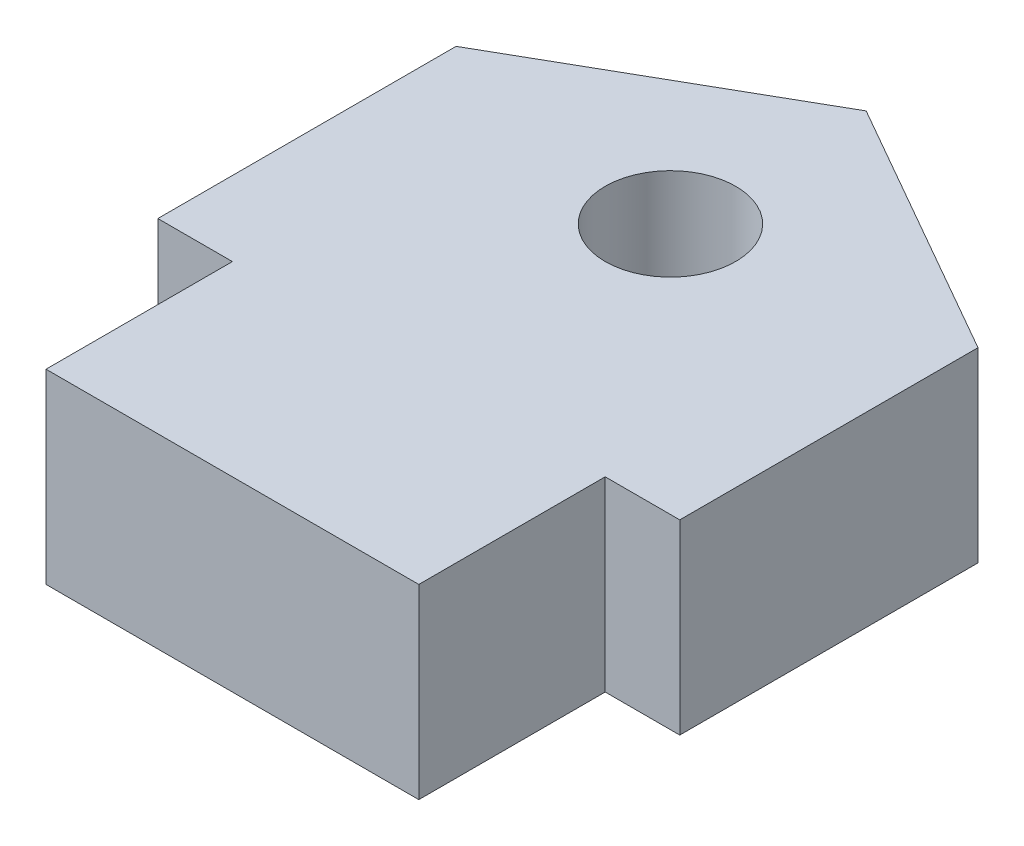
ISO-10303-21;
HEADER;
FILE_DESCRIPTION(('STEP AP214'),'2;1');
FILE_NAME('part.step','',(''),(''),'','','');
FILE_SCHEMA(('AUTOMOTIVE_DESIGN { 1 0 10303 214 1 1 1 1 }'));
ENDSEC;
DATA;
#1=APPLICATION_CONTEXT('core data for automotive mechanical design processes');
#2=APPLICATION_PROTOCOL_DEFINITION('international standard','automotive_design',2000,#1);
#3=PRODUCT_CONTEXT('',#1,'mechanical');
#4=PRODUCT('Part','Part','',(#3));
#5=PRODUCT_RELATED_PRODUCT_CATEGORY('part','',(#4));
#6=PRODUCT_DEFINITION_FORMATION('','',#4);
#7=PRODUCT_DEFINITION_CONTEXT('part definition',#1,'design');
#8=PRODUCT_DEFINITION('design','',#6,#7);
#9=PRODUCT_DEFINITION_SHAPE('','',#8);
#10=(LENGTH_UNIT() NAMED_UNIT(*) SI_UNIT(.MILLI.,.METRE.));
#11=(NAMED_UNIT(*) PLANE_ANGLE_UNIT() SI_UNIT($,.RADIAN.));
#12=(NAMED_UNIT(*) SI_UNIT($,.STERADIAN.) SOLID_ANGLE_UNIT());
#13=UNCERTAINTY_MEASURE_WITH_UNIT(LENGTH_MEASURE(1.E-05),#10,'distance_accuracy_value','');
#14=(GEOMETRIC_REPRESENTATION_CONTEXT(3) GLOBAL_UNCERTAINTY_ASSIGNED_CONTEXT((#13)) GLOBAL_UNIT_ASSIGNED_CONTEXT((#10,
#11,#12)) REPRESENTATION_CONTEXT('',''));
#15=CARTESIAN_POINT('',(0.,0.,0.));
#16=DIRECTION('',(0.,0.,1.));
#17=DIRECTION('',(1.,0.,0.));
#18=AXIS2_PLACEMENT_3D('',#15,#16,#17);
#19=CARTESIAN_POINT('',(0.,5.,0.));
#20=DIRECTION('',(0.,1.,0.));
#21=DIRECTION('',(0.,0.,1.));
#22=AXIS2_PLACEMENT_3D('',#19,#20,#21);
#23=PLANE('',#22);
#24=DIRECTION('',(0.,0.,1.));
#25=VECTOR('',#24,1.);
#26=CARTESIAN_POINT('',(-214.,5.,56.75));
#27=LINE('',#26,#25);
#28=CARTESIAN_POINT('',(-214.,5.,48.75));
#29=VERTEX_POINT('',#28);
#30=CARTESIAN_POINT('',(-214.,5.,56.75));
#31=VERTEX_POINT('',#30);
#32=EDGE_CURVE('E161',#29,#31,#27,.T.);
#33=ORIENTED_EDGE('',*,*,#32,.T.);
#34=DIRECTION('',(1.,0.,0.));
#35=VECTOR('',#34,1.);
#36=CARTESIAN_POINT('',(-212.,5.,56.75));
#37=LINE('',#36,#35);
#38=CARTESIAN_POINT('',(-212.,5.,56.75));
#39=VERTEX_POINT('',#38);
#40=EDGE_CURVE('E104',#31,#39,#37,.T.);
#41=ORIENTED_EDGE('',*,*,#40,.T.);
#42=DIRECTION('',(0.,0.,1.));
#43=VECTOR('',#42,1.);
#44=CARTESIAN_POINT('',(-212.,5.,56.75));
#45=LINE('',#44,#43);
#46=CARTESIAN_POINT('',(-212.,5.,61.75));
#47=VERTEX_POINT('',#46);
#48=EDGE_CURVE('E179',#39,#47,#45,.T.);
#49=ORIENTED_EDGE('',*,*,#48,.T.);
#50=DIRECTION('',(1.,0.,0.));
#51=VECTOR('',#50,1.);
#52=CARTESIAN_POINT('',(-212.,5.,61.75));
#53=LINE('',#52,#51);
#54=CARTESIAN_POINT('',(-202.,5.,61.75));
#55=VERTEX_POINT('',#54);
#56=EDGE_CURVE('E196',#47,#55,#53,.T.);
#57=ORIENTED_EDGE('',*,*,#56,.T.);
#58=DIRECTION('',(0.,0.,-1.));
#59=VECTOR('',#58,1.);
#60=CARTESIAN_POINT('',(-202.,5.,61.75));
#61=LINE('',#60,#59);
#62=CARTESIAN_POINT('',(-202.,5.,56.75));
#63=VERTEX_POINT('',#62);
#64=EDGE_CURVE('E195',#55,#63,#61,.T.);
#65=ORIENTED_EDGE('',*,*,#64,.T.);
#66=DIRECTION('',(1.,0.,0.));
#67=VECTOR('',#66,1.);
#68=CARTESIAN_POINT('',(-200.,5.,56.75));
#69=LINE('',#68,#67);
#70=CARTESIAN_POINT('',(-200.,5.,56.75));
#71=VERTEX_POINT('',#70);
#72=EDGE_CURVE('E126',#63,#71,#69,.T.);
#73=ORIENTED_EDGE('',*,*,#72,.T.);
#74=DIRECTION('',(0.,0.,-1.));
#75=VECTOR('',#74,1.);
#76=CARTESIAN_POINT('',(-200.,5.,48.75));
#77=LINE('',#76,#75);
#78=CARTESIAN_POINT('',(-200.,5.,48.75));
#79=VERTEX_POINT('',#78);
#80=EDGE_CURVE('E120',#71,#79,#77,.T.);
#81=ORIENTED_EDGE('',*,*,#80,.T.);
#82=DIRECTION('',(-0.868243142124459,0.,-0.496138938356834));
#83=VECTOR('',#82,1.);
#84=CARTESIAN_POINT('',(-207.,5.,44.75));
#85=LINE('',#84,#83);
#86=CARTESIAN_POINT('',(-207.,5.,44.75));
#87=VERTEX_POINT('',#86);
#88=EDGE_CURVE('E124',#79,#87,#85,.T.);
#89=ORIENTED_EDGE('',*,*,#88,.T.);
#90=DIRECTION('',(-0.868243142124459,0.,0.496138938356834));
#91=VECTOR('',#90,1.);
#92=CARTESIAN_POINT('',(-214.,5.,48.75));
#93=LINE('',#92,#91);
#94=EDGE_CURVE('E58',#87,#29,#93,.T.);
#95=ORIENTED_EDGE('',*,*,#94,.T.);
#96=EDGE_LOOP('',(#33,#41,#49,#57,#65,#73,#81,#89,#95));
#97=FACE_BOUND('',#96,.T.);
#98=CARTESIAN_POINT('',(-207.,5.,50.));
#99=DIRECTION('',(0.,1.,0.));
#100=DIRECTION('',(0.,0.,1.));
#101=AXIS2_PLACEMENT_3D('',#98,#99,#100);
#102=CIRCLE('',#101,1.75000000000001);
#103=CARTESIAN_POINT('',(-207.,5.,51.75));
#104=VERTEX_POINT('',#103);
#105=EDGE_CURVE('E148',#104,#104,#102,.T.);
#106=ORIENTED_EDGE('',*,*,#105,.F.);
#107=EDGE_LOOP('',(#106));
#108=FACE_BOUND('',#107,.T.);
#109=ADVANCED_FACE('F41',(#97,#108),#23,.T.);
#110=CARTESIAN_POINT('',(0.,0.,0.));
#111=DIRECTION('',(0.,1.,0.));
#112=DIRECTION('',(0.,0.,1.));
#113=AXIS2_PLACEMENT_3D('',#110,#111,#112);
#114=PLANE('',#113);
#115=DIRECTION('',(0.,0.,1.));
#116=VECTOR('',#115,1.);
#117=CARTESIAN_POINT('',(-214.,0.,56.75));
#118=LINE('',#117,#116);
#119=CARTESIAN_POINT('',(-214.,0.,48.75));
#120=VERTEX_POINT('',#119);
#121=CARTESIAN_POINT('',(-214.,0.,56.75));
#122=VERTEX_POINT('',#121);
#123=EDGE_CURVE('E144',#120,#122,#118,.T.);
#124=ORIENTED_EDGE('',*,*,#123,.F.);
#125=DIRECTION('',(-0.868243142124459,0.,0.496138938356834));
#126=VECTOR('',#125,1.);
#127=CARTESIAN_POINT('',(-214.,0.,48.75));
#128=LINE('',#127,#126);
#129=CARTESIAN_POINT('',(-207.,0.,44.75));
#130=VERTEX_POINT('',#129);
#131=EDGE_CURVE('E96',#130,#120,#128,.T.);
#132=ORIENTED_EDGE('',*,*,#131,.F.);
#133=DIRECTION('',(-0.868243142124459,0.,-0.496138938356834));
#134=VECTOR('',#133,1.);
#135=CARTESIAN_POINT('',(-207.,0.,44.75));
#136=LINE('',#135,#134);
#137=CARTESIAN_POINT('',(-200.,0.,48.75));
#138=VERTEX_POINT('',#137);
#139=EDGE_CURVE('E90',#138,#130,#136,.T.);
#140=ORIENTED_EDGE('',*,*,#139,.F.);
#141=DIRECTION('',(0.,0.,-1.));
#142=VECTOR('',#141,1.);
#143=CARTESIAN_POINT('',(-200.,0.,48.75));
#144=LINE('',#143,#142);
#145=CARTESIAN_POINT('',(-200.,0.,56.75));
#146=VERTEX_POINT('',#145);
#147=EDGE_CURVE('E134',#146,#138,#144,.T.);
#148=ORIENTED_EDGE('',*,*,#147,.F.);
#149=DIRECTION('',(1.,0.,0.));
#150=VECTOR('',#149,1.);
#151=CARTESIAN_POINT('',(-200.,0.,56.75));
#152=LINE('',#151,#150);
#153=CARTESIAN_POINT('',(-202.,0.,56.75));
#154=VERTEX_POINT('',#153);
#155=EDGE_CURVE('E156',#154,#146,#152,.T.);
#156=ORIENTED_EDGE('',*,*,#155,.F.);
#157=DIRECTION('',(0.,0.,-1.));
#158=VECTOR('',#157,1.);
#159=CARTESIAN_POINT('',(-202.,0.,61.75));
#160=LINE('',#159,#158);
#161=CARTESIAN_POINT('',(-202.,0.,61.75));
#162=VERTEX_POINT('',#161);
#163=EDGE_CURVE('E154',#162,#154,#160,.T.);
#164=ORIENTED_EDGE('',*,*,#163,.F.);
#165=DIRECTION('',(1.,0.,0.));
#166=VECTOR('',#165,1.);
#167=CARTESIAN_POINT('',(-212.,0.,61.75));
#168=LINE('',#167,#166);
#169=CARTESIAN_POINT('',(-212.,0.,61.75));
#170=VERTEX_POINT('',#169);
#171=EDGE_CURVE('E152',#170,#162,#168,.T.);
#172=ORIENTED_EDGE('',*,*,#171,.F.);
#173=DIRECTION('',(0.,0.,1.));
#174=VECTOR('',#173,1.);
#175=CARTESIAN_POINT('',(-212.,0.,56.75));
#176=LINE('',#175,#174);
#177=CARTESIAN_POINT('',(-212.,0.,56.75));
#178=VERTEX_POINT('',#177);
#179=EDGE_CURVE('E150',#178,#170,#176,.T.);
#180=ORIENTED_EDGE('',*,*,#179,.F.);
#181=DIRECTION('',(1.,0.,0.));
#182=VECTOR('',#181,1.);
#183=CARTESIAN_POINT('',(-212.,0.,56.75));
#184=LINE('',#183,#182);
#185=EDGE_CURVE('E147',#122,#178,#184,.T.);
#186=ORIENTED_EDGE('',*,*,#185,.F.);
#187=EDGE_LOOP('',(#124,#132,#140,#148,#156,#164,#172,#180,#186));
#188=FACE_BOUND('',#187,.T.);
#189=CARTESIAN_POINT('',(-207.,0.,50.));
#190=DIRECTION('',(0.,1.,0.));
#191=DIRECTION('',(0.,0.,1.));
#192=AXIS2_PLACEMENT_3D('',#189,#190,#191);
#193=CIRCLE('',#192,1.75000000000001);
#194=CARTESIAN_POINT('',(-207.,0.,51.75));
#195=VERTEX_POINT('',#194);
#196=EDGE_CURVE('E203',#195,#195,#193,.T.);
#197=ORIENTED_EDGE('',*,*,#196,.T.);
#198=EDGE_LOOP('',(#197));
#199=FACE_BOUND('',#198,.T.);
#200=ADVANCED_FACE('F183',(#188,#199),#114,.F.);
#201=CARTESIAN_POINT('',(-214.,5.,56.75));
#202=DIRECTION('',(1.,0.,0.));
#203=DIRECTION('',(0.,0.,-1.));
#204=AXIS2_PLACEMENT_3D('',#201,#202,#203);
#205=PLANE('',#204);
#206=ORIENTED_EDGE('',*,*,#123,.T.);
#207=DIRECTION('',(0.,-1.,0.));
#208=VECTOR('',#207,1.);
#209=CARTESIAN_POINT('',(-214.,5.,56.75));
#210=LINE('',#209,#208);
#211=EDGE_CURVE('E11',#31,#122,#210,.T.);
#212=ORIENTED_EDGE('',*,*,#211,.F.);
#213=ORIENTED_EDGE('',*,*,#32,.F.);
#214=DIRECTION('',(0.,-1.,0.));
#215=VECTOR('',#214,1.);
#216=CARTESIAN_POINT('',(-214.,5.,48.75));
#217=LINE('',#216,#215);
#218=EDGE_CURVE('E140',#29,#120,#217,.T.);
#219=ORIENTED_EDGE('',*,*,#218,.T.);
#220=EDGE_LOOP('',(#206,#212,#213,#219));
#221=FACE_BOUND('',#220,.T.);
#222=ADVANCED_FACE('F43',(#221),#205,.F.);
#223=CARTESIAN_POINT('',(-212.,5.,56.75));
#224=DIRECTION('',(0.,0.,-1.));
#225=DIRECTION('',(-1.,0.,0.));
#226=AXIS2_PLACEMENT_3D('',#223,#224,#225);
#227=PLANE('',#226);
#228=ORIENTED_EDGE('',*,*,#185,.T.);
#229=DIRECTION('',(0.,-1.,0.));
#230=VECTOR('',#229,1.);
#231=CARTESIAN_POINT('',(-212.,5.,56.75));
#232=LINE('',#231,#230);
#233=EDGE_CURVE('E50',#39,#178,#232,.T.);
#234=ORIENTED_EDGE('',*,*,#233,.F.);
#235=ORIENTED_EDGE('',*,*,#40,.F.);
#236=ORIENTED_EDGE('',*,*,#211,.T.);
#237=EDGE_LOOP('',(#228,#234,#235,#236));
#238=FACE_BOUND('',#237,.T.);
#239=ADVANCED_FACE('F235',(#238),#227,.F.);
#240=CARTESIAN_POINT('',(-212.,5.,56.75));
#241=DIRECTION('',(1.,0.,0.));
#242=DIRECTION('',(0.,0.,-1.));
#243=AXIS2_PLACEMENT_3D('',#240,#241,#242);
#244=PLANE('',#243);
#245=ORIENTED_EDGE('',*,*,#179,.T.);
#246=DIRECTION('',(0.,-1.,0.));
#247=VECTOR('',#246,1.);
#248=CARTESIAN_POINT('',(-212.,5.,61.75));
#249=LINE('',#248,#247);
#250=EDGE_CURVE('E171',#47,#170,#249,.T.);
#251=ORIENTED_EDGE('',*,*,#250,.F.);
#252=ORIENTED_EDGE('',*,*,#48,.F.);
#253=ORIENTED_EDGE('',*,*,#233,.T.);
#254=EDGE_LOOP('',(#245,#251,#252,#253));
#255=FACE_BOUND('',#254,.T.);
#256=ADVANCED_FACE('F177',(#255),#244,.F.);
#257=CARTESIAN_POINT('',(-212.,5.,61.75));
#258=DIRECTION('',(0.,0.,-1.));
#259=DIRECTION('',(-1.,0.,0.));
#260=AXIS2_PLACEMENT_3D('',#257,#258,#259);
#261=PLANE('',#260);
#262=ORIENTED_EDGE('',*,*,#171,.T.);
#263=DIRECTION('',(0.,-1.,0.));
#264=VECTOR('',#263,1.);
#265=CARTESIAN_POINT('',(-202.,5.,61.75));
#266=LINE('',#265,#264);
#267=EDGE_CURVE('E168',#55,#162,#266,.T.);
#268=ORIENTED_EDGE('',*,*,#267,.F.);
#269=ORIENTED_EDGE('',*,*,#56,.F.);
#270=ORIENTED_EDGE('',*,*,#250,.T.);
#271=EDGE_LOOP('',(#262,#268,#269,#270));
#272=FACE_BOUND('',#271,.T.);
#273=ADVANCED_FACE('F189',(#272),#261,.F.);
#274=CARTESIAN_POINT('',(-202.,5.,61.75));
#275=DIRECTION('',(-1.,0.,0.));
#276=DIRECTION('',(0.,0.,1.));
#277=AXIS2_PLACEMENT_3D('',#274,#275,#276);
#278=PLANE('',#277);
#279=ORIENTED_EDGE('',*,*,#163,.T.);
#280=DIRECTION('',(0.,-1.,0.));
#281=VECTOR('',#280,1.);
#282=CARTESIAN_POINT('',(-202.,5.,56.75));
#283=LINE('',#282,#281);
#284=EDGE_CURVE('E165',#63,#154,#283,.T.);
#285=ORIENTED_EDGE('',*,*,#284,.F.);
#286=ORIENTED_EDGE('',*,*,#64,.F.);
#287=ORIENTED_EDGE('',*,*,#267,.T.);
#288=EDGE_LOOP('',(#279,#285,#286,#287));
#289=FACE_BOUND('',#288,.T.);
#290=ADVANCED_FACE('F193',(#289),#278,.F.);
#291=CARTESIAN_POINT('',(-200.,5.,56.75));
#292=DIRECTION('',(0.,0.,-1.));
#293=DIRECTION('',(-1.,0.,0.));
#294=AXIS2_PLACEMENT_3D('',#291,#292,#293);
#295=PLANE('',#294);
#296=ORIENTED_EDGE('',*,*,#155,.T.);
#297=DIRECTION('',(0.,-1.,0.));
#298=VECTOR('',#297,1.);
#299=CARTESIAN_POINT('',(-200.,5.,56.75));
#300=LINE('',#299,#298);
#301=EDGE_CURVE('E135',#71,#146,#300,.T.);
#302=ORIENTED_EDGE('',*,*,#301,.F.);
#303=ORIENTED_EDGE('',*,*,#72,.F.);
#304=ORIENTED_EDGE('',*,*,#284,.T.);
#305=EDGE_LOOP('',(#296,#302,#303,#304));
#306=FACE_BOUND('',#305,.T.);
#307=ADVANCED_FACE('F226',(#306),#295,.F.);
#308=CARTESIAN_POINT('',(-200.,5.,48.75));
#309=DIRECTION('',(-1.,0.,0.));
#310=DIRECTION('',(0.,0.,1.));
#311=AXIS2_PLACEMENT_3D('',#308,#309,#310);
#312=PLANE('',#311);
#313=ORIENTED_EDGE('',*,*,#147,.T.);
#314=DIRECTION('',(0.,-1.,0.));
#315=VECTOR('',#314,1.);
#316=CARTESIAN_POINT('',(-200.,5.,48.75));
#317=LINE('',#316,#315);
#318=EDGE_CURVE('E131',#79,#138,#317,.T.);
#319=ORIENTED_EDGE('',*,*,#318,.F.);
#320=ORIENTED_EDGE('',*,*,#80,.F.);
#321=ORIENTED_EDGE('',*,*,#301,.T.);
#322=EDGE_LOOP('',(#313,#319,#320,#321));
#323=FACE_BOUND('',#322,.T.);
#324=ADVANCED_FACE('F132',(#323),#312,.F.);
#325=CARTESIAN_POINT('',(-207.,5.,44.75));
#326=DIRECTION('',(-0.496138938356834,0.,0.868243142124459));
#327=DIRECTION('',(0.868243142124459,0.,0.496138938356834));
#328=AXIS2_PLACEMENT_3D('',#325,#326,#327);
#329=PLANE('',#328);
#330=ORIENTED_EDGE('',*,*,#139,.T.);
#331=DIRECTION('',(0.,-1.,0.));
#332=VECTOR('',#331,1.);
#333=CARTESIAN_POINT('',(-207.,5.,44.75));
#334=LINE('',#333,#332);
#335=EDGE_CURVE('E136',#87,#130,#334,.T.);
#336=ORIENTED_EDGE('',*,*,#335,.F.);
#337=ORIENTED_EDGE('',*,*,#88,.F.);
#338=ORIENTED_EDGE('',*,*,#318,.T.);
#339=EDGE_LOOP('',(#330,#336,#337,#338));
#340=FACE_BOUND('',#339,.T.);
#341=ADVANCED_FACE('F138',(#340),#329,.F.);
#342=CARTESIAN_POINT('',(-214.,5.,48.75));
#343=DIRECTION('',(0.496138938356834,0.,0.868243142124459));
#344=DIRECTION('',(0.868243142124459,0.,-0.496138938356834));
#345=AXIS2_PLACEMENT_3D('',#342,#343,#344);
#346=PLANE('',#345);
#347=ORIENTED_EDGE('',*,*,#131,.T.);
#348=ORIENTED_EDGE('',*,*,#218,.F.);
#349=ORIENTED_EDGE('',*,*,#94,.F.);
#350=ORIENTED_EDGE('',*,*,#335,.T.);
#351=EDGE_LOOP('',(#347,#348,#349,#350));
#352=FACE_BOUND('',#351,.T.);
#353=ADVANCED_FACE('F219',(#352),#346,.F.);
#354=CARTESIAN_POINT('',(-207.,5.,50.));
#355=DIRECTION('',(0.,-1.,0.));
#356=DIRECTION('',(0.,0.,-1.));
#357=AXIS2_PLACEMENT_3D('',#354,#355,#356);
#358=CYLINDRICAL_SURFACE('',#357,1.75000000000001);
#359=ORIENTED_EDGE('',*,*,#105,.T.);
#360=EDGE_LOOP('',(#359));
#361=FACE_BOUND('',#360,.T.);
#362=ORIENTED_EDGE('',*,*,#196,.F.);
#363=EDGE_LOOP('',(#362));
#364=FACE_BOUND('',#363,.T.);
#365=ADVANCED_FACE('F209',(#361,#364),#358,.F.);
#366=CLOSED_SHELL('',(#109,#200,#222,#239,#256,#273,#290,#307,#324,#341,#353,#365));
#367=MANIFOLD_SOLID_BREP('B2',#366);
#368=ADVANCED_BREP_SHAPE_REPRESENTATION('',(#18,#367),#14);
#369=SHAPE_DEFINITION_REPRESENTATION(#9,#368);
ENDSEC;
END-ISO-10303-21;
